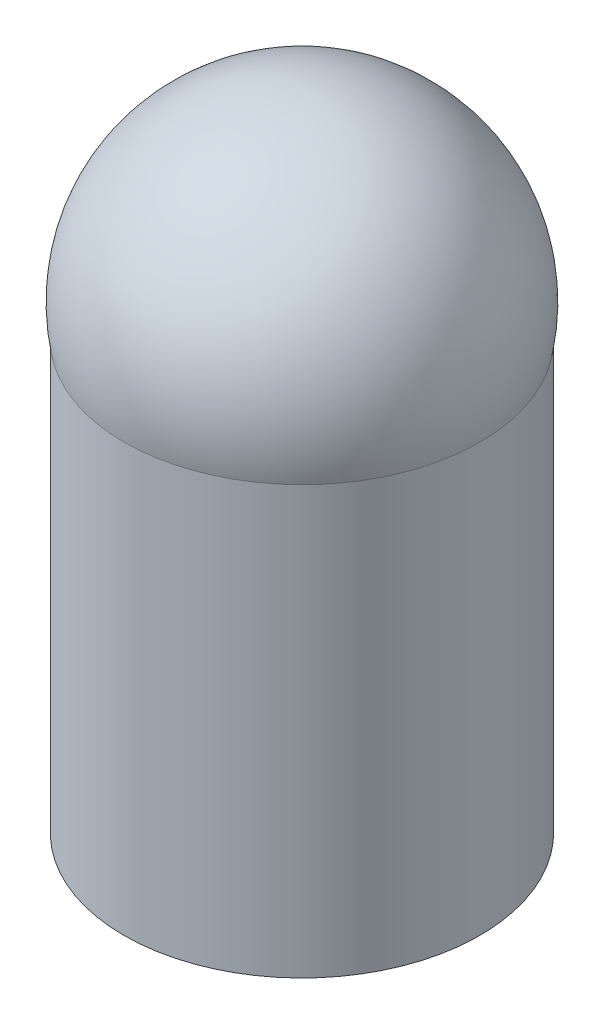
ISO-10303-21;
HEADER;
FILE_DESCRIPTION(('STEP AP214'),'2;1');
FILE_NAME('part.step','',(''),(''),'','','');
FILE_SCHEMA(('AUTOMOTIVE_DESIGN { 1 0 10303 214 1 1 1 1 }'));
ENDSEC;
DATA;
#1=APPLICATION_CONTEXT('core data for automotive mechanical design processes');
#2=APPLICATION_PROTOCOL_DEFINITION('international standard','automotive_design',2000,#1);
#3=PRODUCT_CONTEXT('',#1,'mechanical');
#4=PRODUCT('Part','Part','',(#3));
#5=PRODUCT_RELATED_PRODUCT_CATEGORY('part','',(#4));
#6=PRODUCT_DEFINITION_FORMATION('','',#4);
#7=PRODUCT_DEFINITION_CONTEXT('part definition',#1,'design');
#8=PRODUCT_DEFINITION('design','',#6,#7);
#9=PRODUCT_DEFINITION_SHAPE('','',#8);
#10=(LENGTH_UNIT() NAMED_UNIT(*) SI_UNIT(.MILLI.,.METRE.));
#11=(NAMED_UNIT(*) PLANE_ANGLE_UNIT() SI_UNIT($,.RADIAN.));
#12=(NAMED_UNIT(*) SI_UNIT($,.STERADIAN.) SOLID_ANGLE_UNIT());
#13=UNCERTAINTY_MEASURE_WITH_UNIT(LENGTH_MEASURE(1.E-05),#10,'distance_accuracy_value','');
#14=(GEOMETRIC_REPRESENTATION_CONTEXT(3) GLOBAL_UNCERTAINTY_ASSIGNED_CONTEXT((#13)) GLOBAL_UNIT_ASSIGNED_CONTEXT((#10,
#11,#12)) REPRESENTATION_CONTEXT('',''));
#15=CARTESIAN_POINT('',(0.,0.,0.));
#16=DIRECTION('',(0.,0.,1.));
#17=DIRECTION('',(1.,0.,0.));
#18=AXIS2_PLACEMENT_3D('',#15,#16,#17);
#19=CARTESIAN_POINT('',(-23.3046739183895,6.,-11.2598010972422));
#20=DIRECTION('',(0.,-1.,0.));
#21=DIRECTION('',(0.,0.,-1.));
#22=AXIS2_PLACEMENT_3D('',#19,#20,#21);
#23=CYLINDRICAL_SURFACE('',#22,2.5);
#24=CARTESIAN_POINT('',(-23.3046739183895,6.,-11.2598010972422));
#25=DIRECTION('',(0.,1.,0.));
#26=DIRECTION('',(0.,0.,1.));
#27=AXIS2_PLACEMENT_3D('',#24,#25,#26);
#28=CIRCLE('',#27,2.5);
#29=CARTESIAN_POINT('',(-23.3046739183895,6.,-8.75980109724221));
#30=VERTEX_POINT('',#29);
#31=EDGE_CURVE('E10',#30,#30,#28,.T.);
#32=ORIENTED_EDGE('',*,*,#31,.F.);
#33=EDGE_LOOP('',(#32));
#34=FACE_BOUND('',#33,.T.);
#35=CARTESIAN_POINT('',(-23.3046739183895,0.,-11.2598010972422));
#36=DIRECTION('',(0.,1.,0.));
#37=DIRECTION('',(0.,0.,1.));
#38=AXIS2_PLACEMENT_3D('',#35,#36,#37);
#39=CIRCLE('',#38,2.5);
#40=CARTESIAN_POINT('',(-23.3046739183895,0.,-8.75980109724221));
#41=VERTEX_POINT('',#40);
#42=EDGE_CURVE('E38',#41,#41,#39,.T.);
#43=ORIENTED_EDGE('',*,*,#42,.T.);
#44=EDGE_LOOP('',(#43));
#45=FACE_BOUND('',#44,.T.);
#46=ADVANCED_FACE('F31',(#34,#45),#23,.T.);
#47=CARTESIAN_POINT('',(-23.3046739183895,6.45833333333333,-11.2598010972422));
#48=DIRECTION('',(0.,0.,1.));
#49=DIRECTION('',(1.,0.,0.));
#50=AXIS2_PLACEMENT_3D('',#47,#48,#49);
#51=SPHERICAL_SURFACE('',#50,2.54166666666667);
#52=CARTESIAN_POINT('',(-23.3046739183895,6.45833333333333,-11.2598010972422));
#53=DIRECTION('',(0.,1.,0.));
#54=DIRECTION('',(0.,0.,1.));
#55=AXIS2_PLACEMENT_3D('',#52,#53,#54);
#56=SPHERICAL_SURFACE('',#55,2.54166666666667);
#57=ORIENTED_EDGE('',*,*,#31,.T.);
#58=EDGE_LOOP('',(#57));
#59=FACE_BOUND('',#58,.T.);
#60=ADVANCED_FACE('F33',(#59),#56,.T.);
#61=CARTESIAN_POINT('',(-23.3046739183895,0.,-11.2598010972422));
#62=DIRECTION('',(0.,1.,0.));
#63=DIRECTION('',(0.,0.,1.));
#64=AXIS2_PLACEMENT_3D('',#61,#62,#63);
#65=PLANE('',#64);
#66=ORIENTED_EDGE('',*,*,#42,.F.);
#67=EDGE_LOOP('',(#66));
#68=FACE_BOUND('',#67,.T.);
#69=ADVANCED_FACE('F45',(#68),#65,.F.);
#70=CLOSED_SHELL('',(#46,#60,#69));
#71=MANIFOLD_SOLID_BREP('B2',#70);
#72=ADVANCED_BREP_SHAPE_REPRESENTATION('',(#18,#71),#14);
#73=SHAPE_DEFINITION_REPRESENTATION(#9,#72);
ENDSEC;
END-ISO-10303-21;
